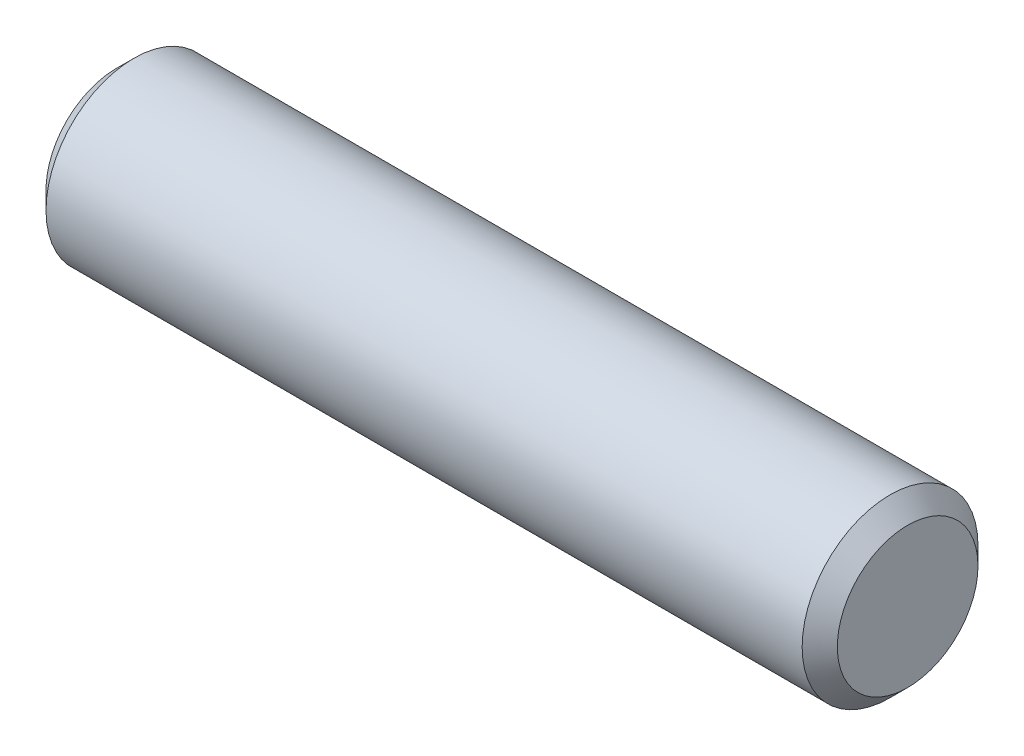
ISO-10303-21;
HEADER;
FILE_DESCRIPTION(('STEP AP214'),'2;1');
FILE_NAME('part.step','',(''),(''),'','','');
FILE_SCHEMA(('AUTOMOTIVE_DESIGN { 1 0 10303 214 1 1 1 1 }'));
ENDSEC;
DATA;
#1=APPLICATION_CONTEXT('core data for automotive mechanical design processes');
#2=APPLICATION_PROTOCOL_DEFINITION('international standard','automotive_design',2000,#1);
#3=PRODUCT_CONTEXT('',#1,'mechanical');
#4=PRODUCT('Part','Part','',(#3));
#5=PRODUCT_RELATED_PRODUCT_CATEGORY('part','',(#4));
#6=PRODUCT_DEFINITION_FORMATION('','',#4);
#7=PRODUCT_DEFINITION_CONTEXT('part definition',#1,'design');
#8=PRODUCT_DEFINITION('design','',#6,#7);
#9=PRODUCT_DEFINITION_SHAPE('','',#8);
#10=(LENGTH_UNIT() NAMED_UNIT(*) SI_UNIT(.MILLI.,.METRE.));
#11=(NAMED_UNIT(*) PLANE_ANGLE_UNIT() SI_UNIT($,.RADIAN.));
#12=(NAMED_UNIT(*) SI_UNIT($,.STERADIAN.) SOLID_ANGLE_UNIT());
#13=UNCERTAINTY_MEASURE_WITH_UNIT(LENGTH_MEASURE(1.E-05),#10,'distance_accuracy_value','');
#14=(GEOMETRIC_REPRESENTATION_CONTEXT(3) GLOBAL_UNCERTAINTY_ASSIGNED_CONTEXT((#13)) GLOBAL_UNIT_ASSIGNED_CONTEXT((#10,
#11,#12)) REPRESENTATION_CONTEXT('',''));
#15=CARTESIAN_POINT('',(0.,0.,0.));
#16=DIRECTION('',(0.,0.,1.));
#17=DIRECTION('',(1.,0.,0.));
#18=AXIS2_PLACEMENT_3D('',#15,#16,#17);
#19=CARTESIAN_POINT('',(-28.575,0.,0.));
#20=DIRECTION('',(1.,0.,0.));
#21=DIRECTION('',(0.,0.,-1.));
#22=AXIS2_PLACEMENT_3D('',#19,#20,#21);
#23=CYLINDRICAL_SURFACE('',#22,6.35);
#24=CARTESIAN_POINT('',(27.305,0.,0.));
#25=DIRECTION('',(1.,0.,0.));
#26=DIRECTION('',(0.,0.,-1.));
#27=AXIS2_PLACEMENT_3D('',#24,#25,#26);
#28=CIRCLE('',#27,6.35);
#29=CARTESIAN_POINT('',(27.305,0.,-6.35));
#30=VERTEX_POINT('',#29);
#31=EDGE_CURVE('E37',#30,#30,#28,.F.);
#32=ORIENTED_EDGE('',*,*,#31,.T.);
#33=EDGE_LOOP('',(#32));
#34=FACE_BOUND('',#33,.T.);
#35=CARTESIAN_POINT('',(-27.305,0.,0.));
#36=DIRECTION('',(1.,0.,0.));
#37=DIRECTION('',(0.,0.,-1.));
#38=AXIS2_PLACEMENT_3D('',#35,#36,#37);
#39=CIRCLE('',#38,6.35);
#40=CARTESIAN_POINT('',(-27.305,0.,-6.35));
#41=VERTEX_POINT('',#40);
#42=EDGE_CURVE('E41',#41,#41,#39,.T.);
#43=ORIENTED_EDGE('',*,*,#42,.T.);
#44=EDGE_LOOP('',(#43));
#45=FACE_BOUND('',#44,.T.);
#46=ADVANCED_FACE('F30',(#34,#45),#23,.T.);
#47=CARTESIAN_POINT('',(-28.575,0.,0.));
#48=DIRECTION('',(1.,0.,0.));
#49=DIRECTION('',(0.,0.,-1.));
#50=AXIS2_PLACEMENT_3D('',#47,#48,#49);
#51=PLANE('',#50);
#52=CARTESIAN_POINT('',(-28.575,0.,0.));
#53=DIRECTION('',(1.,0.,0.));
#54=DIRECTION('',(0.,0.,-1.));
#55=AXIS2_PLACEMENT_3D('',#52,#53,#54);
#56=CIRCLE('',#55,5.07999999999999);
#57=CARTESIAN_POINT('',(-28.575,0.,-5.07999999999999));
#58=VERTEX_POINT('',#57);
#59=EDGE_CURVE('E10',#58,#58,#56,.F.);
#60=ORIENTED_EDGE('',*,*,#59,.T.);
#61=EDGE_LOOP('',(#60));
#62=FACE_BOUND('',#61,.T.);
#63=ADVANCED_FACE('F61',(#62),#51,.F.);
#64=CARTESIAN_POINT('',(28.575,0.,0.));
#65=DIRECTION('',(1.,0.,0.));
#66=DIRECTION('',(0.,0.,-1.));
#67=AXIS2_PLACEMENT_3D('',#64,#65,#66);
#68=PLANE('',#67);
#69=CARTESIAN_POINT('',(28.575,0.,0.));
#70=DIRECTION('',(1.,0.,0.));
#71=DIRECTION('',(0.,0.,-1.));
#72=AXIS2_PLACEMENT_3D('',#69,#70,#71);
#73=CIRCLE('',#72,5.08000000000001);
#74=CARTESIAN_POINT('',(28.575,0.,-5.08000000000001));
#75=VERTEX_POINT('',#74);
#76=EDGE_CURVE('E45',#75,#75,#73,.T.);
#77=ORIENTED_EDGE('',*,*,#76,.T.);
#78=EDGE_LOOP('',(#77));
#79=FACE_BOUND('',#78,.T.);
#80=ADVANCED_FACE('F51',(#79),#68,.T.);
#81=CARTESIAN_POINT('',(28.575,0.,0.));
#82=DIRECTION('',(-1.,0.,0.));
#83=DIRECTION('',(0.,0.,1.));
#84=AXIS2_PLACEMENT_3D('',#81,#82,#83);
#85=CONICAL_SURFACE('',#84,5.08000000000001,0.785398163397442);
#86=ORIENTED_EDGE('',*,*,#31,.F.);
#87=EDGE_LOOP('',(#86));
#88=FACE_BOUND('',#87,.T.);
#89=ORIENTED_EDGE('',*,*,#76,.F.);
#90=EDGE_LOOP('',(#89));
#91=FACE_BOUND('',#90,.T.);
#92=ADVANCED_FACE('F53',(#88,#91),#85,.T.);
#93=CARTESIAN_POINT('',(-27.305,0.,0.));
#94=DIRECTION('',(1.,0.,0.));
#95=DIRECTION('',(0.,0.,-1.));
#96=AXIS2_PLACEMENT_3D('',#93,#94,#95);
#97=CONICAL_SURFACE('',#96,6.35,0.78539816339745);
#98=ORIENTED_EDGE('',*,*,#59,.F.);
#99=EDGE_LOOP('',(#98));
#100=FACE_BOUND('',#99,.T.);
#101=ORIENTED_EDGE('',*,*,#42,.F.);
#102=EDGE_LOOP('',(#101));
#103=FACE_BOUND('',#102,.T.);
#104=ADVANCED_FACE('F32',(#100,#103),#97,.T.);
#105=CLOSED_SHELL('',(#46,#63,#80,#92,#104));
#106=MANIFOLD_SOLID_BREP('B2',#105);
#107=ADVANCED_BREP_SHAPE_REPRESENTATION('',(#18,#106),#14);
#108=SHAPE_DEFINITION_REPRESENTATION(#9,#107);
ENDSEC;
END-ISO-10303-21;
